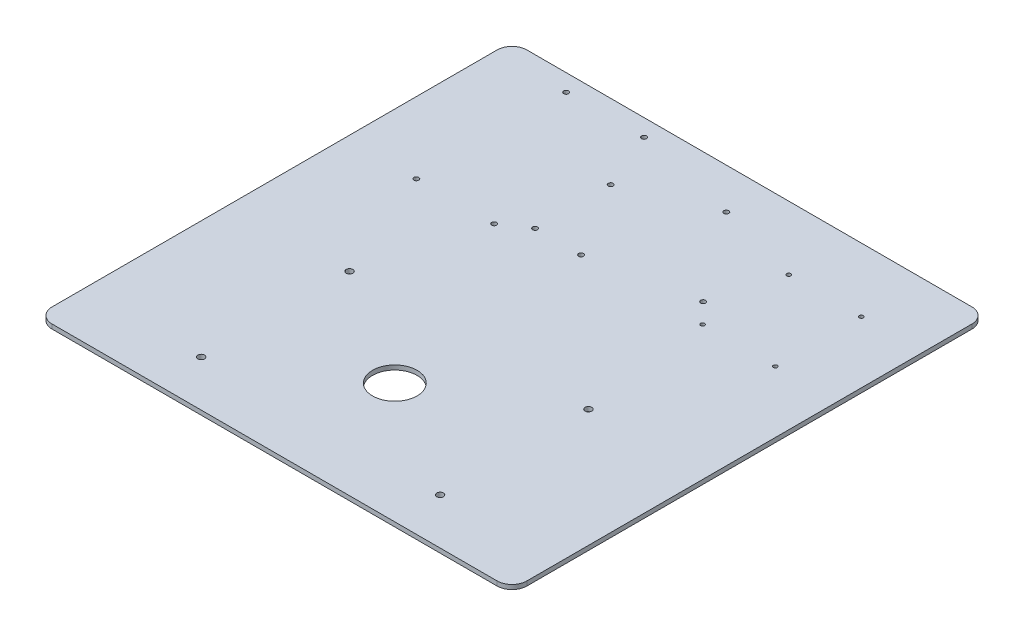
ISO-10303-21;
HEADER;
FILE_DESCRIPTION(('STEP AP214'),'2;1');
FILE_NAME('part.step','',(''),(''),'','','');
FILE_SCHEMA(('AUTOMOTIVE_DESIGN { 1 0 10303 214 1 1 1 1 }'));
ENDSEC;
DATA;
#1=APPLICATION_CONTEXT('core data for automotive mechanical design processes');
#2=APPLICATION_PROTOCOL_DEFINITION('international standard','automotive_design',2000,#1);
#3=PRODUCT_CONTEXT('',#1,'mechanical');
#4=PRODUCT('Part','Part','',(#3));
#5=PRODUCT_RELATED_PRODUCT_CATEGORY('part','',(#4));
#6=PRODUCT_DEFINITION_FORMATION('','',#4);
#7=PRODUCT_DEFINITION_CONTEXT('part definition',#1,'design');
#8=PRODUCT_DEFINITION('design','',#6,#7);
#9=PRODUCT_DEFINITION_SHAPE('','',#8);
#10=(LENGTH_UNIT() NAMED_UNIT(*) SI_UNIT(.MILLI.,.METRE.));
#11=(NAMED_UNIT(*) PLANE_ANGLE_UNIT() SI_UNIT($,.RADIAN.));
#12=(NAMED_UNIT(*) SI_UNIT($,.STERADIAN.) SOLID_ANGLE_UNIT());
#13=UNCERTAINTY_MEASURE_WITH_UNIT(LENGTH_MEASURE(1.E-05),#10,'distance_accuracy_value','');
#14=(GEOMETRIC_REPRESENTATION_CONTEXT(3) GLOBAL_UNCERTAINTY_ASSIGNED_CONTEXT((#13)) GLOBAL_UNIT_ASSIGNED_CONTEXT((#10,
#11,#12)) REPRESENTATION_CONTEXT('',''));
#15=CARTESIAN_POINT('',(0.,0.,0.));
#16=DIRECTION('',(0.,0.,1.));
#17=DIRECTION('',(1.,0.,0.));
#18=AXIS2_PLACEMENT_3D('',#15,#16,#17);
#19=CARTESIAN_POINT('',(205.2,3.,0.));
#20=DIRECTION('',(1.,0.,0.));
#21=DIRECTION('',(0.,0.,-1.));
#22=AXIS2_PLACEMENT_3D('',#19,#20,#21);
#23=PLANE('',#22);
#24=DIRECTION('',(0.,0.,1.));
#25=VECTOR('',#24,1.);
#26=CARTESIAN_POINT('',(205.2,0.,0.));
#27=LINE('',#26,#25);
#28=CARTESIAN_POINT('',(205.2,0.,-93.57));
#29=VERTEX_POINT('',#28);
#30=CARTESIAN_POINT('',(205.2,0.,206.43));
#31=VERTEX_POINT('',#30);
#32=EDGE_CURVE('E121',#29,#31,#27,.T.);
#33=ORIENTED_EDGE('',*,*,#32,.F.);
#34=DIRECTION('',(0.,-1.,0.));
#35=VECTOR('',#34,1.);
#36=CARTESIAN_POINT('',(205.2,3.,-93.57));
#37=LINE('',#36,#35);
#38=CARTESIAN_POINT('',(205.2,3.,-93.57));
#39=VERTEX_POINT('',#38);
#40=EDGE_CURVE('E143',#29,#39,#37,.F.);
#41=ORIENTED_EDGE('',*,*,#40,.T.);
#42=DIRECTION('',(0.,0.,1.));
#43=VECTOR('',#42,1.);
#44=CARTESIAN_POINT('',(205.2,3.,0.));
#45=LINE('',#44,#43);
#46=CARTESIAN_POINT('',(205.2,3.,206.43));
#47=VERTEX_POINT('',#46);
#48=EDGE_CURVE('E222',#39,#47,#45,.T.);
#49=ORIENTED_EDGE('',*,*,#48,.T.);
#50=DIRECTION('',(0.,-1.,0.));
#51=VECTOR('',#50,1.);
#52=CARTESIAN_POINT('',(205.2,0.,206.43));
#53=LINE('',#52,#51);
#54=EDGE_CURVE('E140',#47,#31,#53,.T.);
#55=ORIENTED_EDGE('',*,*,#54,.T.);
#56=EDGE_LOOP('',(#33,#41,#49,#55));
#57=FACE_BOUND('',#56,.T.);
#58=ADVANCED_FACE('F34',(#57),#23,.T.);
#59=CARTESIAN_POINT('',(0.,3.,-103.57));
#60=DIRECTION('',(0.,0.,-1.));
#61=DIRECTION('',(-1.,0.,0.));
#62=AXIS2_PLACEMENT_3D('',#59,#60,#61);
#63=PLANE('',#62);
#64=DIRECTION('',(1.,0.,0.));
#65=VECTOR('',#64,1.);
#66=CARTESIAN_POINT('',(0.,3.,-103.57));
#67=LINE('',#66,#65);
#68=CARTESIAN_POINT('',(-104.8,3.,-103.57));
#69=VERTEX_POINT('',#68);
#70=CARTESIAN_POINT('',(195.2,3.,-103.57));
#71=VERTEX_POINT('',#70);
#72=EDGE_CURVE('E225',#69,#71,#67,.T.);
#73=ORIENTED_EDGE('',*,*,#72,.T.);
#74=DIRECTION('',(0.,-1.,0.));
#75=VECTOR('',#74,1.);
#76=CARTESIAN_POINT('',(195.2,3.,-103.57));
#77=LINE('',#76,#75);
#78=CARTESIAN_POINT('',(195.2,0.,-103.57));
#79=VERTEX_POINT('',#78);
#80=EDGE_CURVE('E120',#71,#79,#77,.T.);
#81=ORIENTED_EDGE('',*,*,#80,.T.);
#82=DIRECTION('',(1.,0.,0.));
#83=VECTOR('',#82,1.);
#84=CARTESIAN_POINT('',(0.,0.,-103.57));
#85=LINE('',#84,#83);
#86=CARTESIAN_POINT('',(-104.8,0.,-103.57));
#87=VERTEX_POINT('',#86);
#88=EDGE_CURVE('E103',#87,#79,#85,.T.);
#89=ORIENTED_EDGE('',*,*,#88,.F.);
#90=DIRECTION('',(0.,-1.,0.));
#91=VECTOR('',#90,1.);
#92=CARTESIAN_POINT('',(-104.8,3.,-103.57));
#93=LINE('',#92,#91);
#94=EDGE_CURVE('E117',#87,#69,#93,.F.);
#95=ORIENTED_EDGE('',*,*,#94,.T.);
#96=EDGE_LOOP('',(#73,#81,#89,#95));
#97=FACE_BOUND('',#96,.T.);
#98=ADVANCED_FACE('F116',(#97),#63,.T.);
#99=CARTESIAN_POINT('',(-114.8,3.,0.));
#100=DIRECTION('',(1.,0.,0.));
#101=DIRECTION('',(0.,0.,-1.));
#102=AXIS2_PLACEMENT_3D('',#99,#100,#101);
#103=PLANE('',#102);
#104=DIRECTION('',(0.,0.,1.));
#105=VECTOR('',#104,1.);
#106=CARTESIAN_POINT('',(-114.8,3.,0.));
#107=LINE('',#106,#105);
#108=CARTESIAN_POINT('',(-114.8,3.,-93.57));
#109=VERTEX_POINT('',#108);
#110=CARTESIAN_POINT('',(-114.8,3.,206.43));
#111=VERTEX_POINT('',#110);
#112=EDGE_CURVE('E227',#109,#111,#107,.T.);
#113=ORIENTED_EDGE('',*,*,#112,.F.);
#114=DIRECTION('',(0.,-1.,0.));
#115=VECTOR('',#114,1.);
#116=CARTESIAN_POINT('',(-114.8,0.,-93.57));
#117=LINE('',#116,#115);
#118=CARTESIAN_POINT('',(-114.8,0.,-93.57));
#119=VERTEX_POINT('',#118);
#120=EDGE_CURVE('E153',#109,#119,#117,.T.);
#121=ORIENTED_EDGE('',*,*,#120,.T.);
#122=DIRECTION('',(0.,0.,1.));
#123=VECTOR('',#122,1.);
#124=CARTESIAN_POINT('',(-114.8,0.,0.));
#125=LINE('',#124,#123);
#126=CARTESIAN_POINT('',(-114.8,0.,206.43));
#127=VERTEX_POINT('',#126);
#128=EDGE_CURVE('E105',#119,#127,#125,.T.);
#129=ORIENTED_EDGE('',*,*,#128,.T.);
#130=DIRECTION('',(0.,-1.,0.));
#131=VECTOR('',#130,1.);
#132=CARTESIAN_POINT('',(-114.8,3.,206.43));
#133=LINE('',#132,#131);
#134=EDGE_CURVE('E151',#127,#111,#133,.F.);
#135=ORIENTED_EDGE('',*,*,#134,.T.);
#136=EDGE_LOOP('',(#113,#121,#129,#135));
#137=FACE_BOUND('',#136,.T.);
#138=ADVANCED_FACE('F304',(#137),#103,.F.);
#139=CARTESIAN_POINT('',(125.7,3.,85.43));
#140=DIRECTION('',(0.,-1.,0.));
#141=DIRECTION('',(0.,0.,-1.));
#142=AXIS2_PLACEMENT_3D('',#139,#140,#141);
#143=CYLINDRICAL_SURFACE('',#142,2.25000000000001);
#144=CARTESIAN_POINT('',(125.7,3.,85.43));
#145=DIRECTION('',(0.,1.,0.));
#146=DIRECTION('',(0.,0.,1.));
#147=AXIS2_PLACEMENT_3D('',#144,#145,#146);
#148=CIRCLE('',#147,2.25000000000001);
#149=CARTESIAN_POINT('',(125.7,3.,87.68));
#150=VERTEX_POINT('',#149);
#151=EDGE_CURVE('E131',#150,#150,#148,.T.);
#152=ORIENTED_EDGE('',*,*,#151,.T.);
#153=EDGE_LOOP('',(#152));
#154=FACE_BOUND('',#153,.T.);
#155=CARTESIAN_POINT('',(125.7,0.,85.43));
#156=DIRECTION('',(0.,1.,0.));
#157=DIRECTION('',(0.,0.,1.));
#158=AXIS2_PLACEMENT_3D('',#155,#156,#157);
#159=CIRCLE('',#158,2.25000000000001);
#160=CARTESIAN_POINT('',(125.7,0.,87.68));
#161=VERTEX_POINT('',#160);
#162=EDGE_CURVE('E179',#161,#161,#159,.T.);
#163=ORIENTED_EDGE('',*,*,#162,.F.);
#164=EDGE_LOOP('',(#163));
#165=FACE_BOUND('',#164,.T.);
#166=ADVANCED_FACE('F368',(#154,#165),#143,.F.);
#167=CARTESIAN_POINT('',(125.7,3.,185.43));
#168=DIRECTION('',(0.,-1.,0.));
#169=DIRECTION('',(0.,0.,-1.));
#170=AXIS2_PLACEMENT_3D('',#167,#168,#169);
#171=CYLINDRICAL_SURFACE('',#170,2.25000000000001);
#172=CARTESIAN_POINT('',(125.7,3.,185.43));
#173=DIRECTION('',(0.,1.,0.));
#174=DIRECTION('',(0.,0.,1.));
#175=AXIS2_PLACEMENT_3D('',#172,#173,#174);
#176=CIRCLE('',#175,2.25000000000001);
#177=CARTESIAN_POINT('',(125.7,3.,187.68));
#178=VERTEX_POINT('',#177);
#179=EDGE_CURVE('E242',#178,#178,#176,.T.);
#180=ORIENTED_EDGE('',*,*,#179,.T.);
#181=EDGE_LOOP('',(#180));
#182=FACE_BOUND('',#181,.T.);
#183=CARTESIAN_POINT('',(125.7,0.,185.43));
#184=DIRECTION('',(0.,1.,0.));
#185=DIRECTION('',(0.,0.,1.));
#186=AXIS2_PLACEMENT_3D('',#183,#184,#185);
#187=CIRCLE('',#186,2.25000000000001);
#188=CARTESIAN_POINT('',(125.7,0.,187.68));
#189=VERTEX_POINT('',#188);
#190=EDGE_CURVE('E177',#189,#189,#187,.T.);
#191=ORIENTED_EDGE('',*,*,#190,.F.);
#192=EDGE_LOOP('',(#191));
#193=FACE_BOUND('',#192,.T.);
#194=ADVANCED_FACE('F371',(#182,#193),#171,.F.);
#195=CARTESIAN_POINT('',(-35.2999999999999,3.,185.43));
#196=DIRECTION('',(0.,-1.,0.));
#197=DIRECTION('',(0.,0.,-1.));
#198=AXIS2_PLACEMENT_3D('',#195,#196,#197);
#199=CYLINDRICAL_SURFACE('',#198,2.25);
#200=CARTESIAN_POINT('',(-35.2999999999999,3.,185.43));
#201=DIRECTION('',(0.,1.,0.));
#202=DIRECTION('',(0.,0.,1.));
#203=AXIS2_PLACEMENT_3D('',#200,#201,#202);
#204=CIRCLE('',#203,2.25);
#205=CARTESIAN_POINT('',(-35.2999999999999,3.,187.68));
#206=VERTEX_POINT('',#205);
#207=EDGE_CURVE('E239',#206,#206,#204,.T.);
#208=ORIENTED_EDGE('',*,*,#207,.T.);
#209=EDGE_LOOP('',(#208));
#210=FACE_BOUND('',#209,.T.);
#211=CARTESIAN_POINT('',(-35.2999999999999,0.,185.43));
#212=DIRECTION('',(0.,1.,0.));
#213=DIRECTION('',(0.,0.,1.));
#214=AXIS2_PLACEMENT_3D('',#211,#212,#213);
#215=CIRCLE('',#214,2.25);
#216=CARTESIAN_POINT('',(-35.2999999999999,0.,187.68));
#217=VERTEX_POINT('',#216);
#218=EDGE_CURVE('E174',#217,#217,#215,.T.);
#219=ORIENTED_EDGE('',*,*,#218,.F.);
#220=EDGE_LOOP('',(#219));
#221=FACE_BOUND('',#220,.T.);
#222=ADVANCED_FACE('F375',(#210,#221),#199,.F.);
#223=CARTESIAN_POINT('',(45.2,3.,135.43));
#224=DIRECTION('',(0.,-1.,0.));
#225=DIRECTION('',(0.,0.,-1.));
#226=AXIS2_PLACEMENT_3D('',#223,#224,#225);
#227=CYLINDRICAL_SURFACE('',#226,15.);
#228=CARTESIAN_POINT('',(45.2,3.,135.43));
#229=DIRECTION('',(0.,1.,0.));
#230=DIRECTION('',(0.,0.,1.));
#231=AXIS2_PLACEMENT_3D('',#228,#229,#230);
#232=CIRCLE('',#231,15.);
#233=CARTESIAN_POINT('',(45.2,3.,150.43));
#234=VERTEX_POINT('',#233);
#235=EDGE_CURVE('E236',#234,#234,#232,.T.);
#236=ORIENTED_EDGE('',*,*,#235,.T.);
#237=EDGE_LOOP('',(#236));
#238=FACE_BOUND('',#237,.T.);
#239=CARTESIAN_POINT('',(45.2,0.,135.43));
#240=DIRECTION('',(0.,1.,0.));
#241=DIRECTION('',(0.,0.,1.));
#242=AXIS2_PLACEMENT_3D('',#239,#240,#241);
#243=CIRCLE('',#242,15.);
#244=CARTESIAN_POINT('',(45.2,0.,150.43));
#245=VERTEX_POINT('',#244);
#246=EDGE_CURVE('E171',#245,#245,#243,.T.);
#247=ORIENTED_EDGE('',*,*,#246,.F.);
#248=EDGE_LOOP('',(#247));
#249=FACE_BOUND('',#248,.T.);
#250=ADVANCED_FACE('F379',(#238,#249),#227,.F.);
#251=CARTESIAN_POINT('',(-14.3,3.,8.93000000000002));
#252=DIRECTION('',(0.,-1.,0.));
#253=DIRECTION('',(0.,0.,-1.));
#254=AXIS2_PLACEMENT_3D('',#251,#252,#253);
#255=CYLINDRICAL_SURFACE('',#254,1.65);
#256=CARTESIAN_POINT('',(-14.3,3.,8.93000000000002));
#257=DIRECTION('',(0.,1.,0.));
#258=DIRECTION('',(0.,0.,1.));
#259=AXIS2_PLACEMENT_3D('',#256,#257,#258);
#260=CIRCLE('',#259,1.65);
#261=CARTESIAN_POINT('',(-14.3,3.,10.58));
#262=VERTEX_POINT('',#261);
#263=EDGE_CURVE('E233',#262,#262,#260,.T.);
#264=ORIENTED_EDGE('',*,*,#263,.T.);
#265=EDGE_LOOP('',(#264));
#266=FACE_BOUND('',#265,.T.);
#267=CARTESIAN_POINT('',(-14.3,0.,8.93000000000002));
#268=DIRECTION('',(0.,1.,0.));
#269=DIRECTION('',(0.,0.,1.));
#270=AXIS2_PLACEMENT_3D('',#267,#268,#269);
#271=CIRCLE('',#270,1.65);
#272=CARTESIAN_POINT('',(-14.3,0.,10.58));
#273=VERTEX_POINT('',#272);
#274=EDGE_CURVE('E165',#273,#273,#271,.T.);
#275=ORIENTED_EDGE('',*,*,#274,.F.);
#276=EDGE_LOOP('',(#275));
#277=FACE_BOUND('',#276,.T.);
#278=ADVANCED_FACE('F383',(#266,#277),#255,.F.);
#279=CARTESIAN_POINT('',(-66.8,3.,8.93000000000002));
#280=DIRECTION('',(0.,-1.,0.));
#281=DIRECTION('',(0.,0.,-1.));
#282=AXIS2_PLACEMENT_3D('',#279,#280,#281);
#283=CYLINDRICAL_SURFACE('',#282,1.65);
#284=CARTESIAN_POINT('',(-66.8,3.,8.93000000000002));
#285=DIRECTION('',(0.,1.,0.));
#286=DIRECTION('',(0.,0.,1.));
#287=AXIS2_PLACEMENT_3D('',#284,#285,#286);
#288=CIRCLE('',#287,1.65);
#289=CARTESIAN_POINT('',(-66.8,3.,10.58));
#290=VERTEX_POINT('',#289);
#291=EDGE_CURVE('E230',#290,#290,#288,.T.);
#292=ORIENTED_EDGE('',*,*,#291,.T.);
#293=EDGE_LOOP('',(#292));
#294=FACE_BOUND('',#293,.T.);
#295=CARTESIAN_POINT('',(-66.8,0.,8.93000000000002));
#296=DIRECTION('',(0.,1.,0.));
#297=DIRECTION('',(0.,0.,1.));
#298=AXIS2_PLACEMENT_3D('',#295,#296,#297);
#299=CIRCLE('',#298,1.65);
#300=CARTESIAN_POINT('',(-66.8,0.,10.58));
#301=VERTEX_POINT('',#300);
#302=EDGE_CURVE('E162',#301,#301,#299,.T.);
#303=ORIENTED_EDGE('',*,*,#302,.F.);
#304=EDGE_LOOP('',(#303));
#305=FACE_BOUND('',#304,.T.);
#306=ADVANCED_FACE('F387',(#294,#305),#283,.F.);
#307=CARTESIAN_POINT('',(0.,3.,216.43));
#308=DIRECTION('',(0.,0.,-1.));
#309=DIRECTION('',(-1.,0.,0.));
#310=AXIS2_PLACEMENT_3D('',#307,#308,#309);
#311=PLANE('',#310);
#312=DIRECTION('',(1.,0.,0.));
#313=VECTOR('',#312,1.);
#314=CARTESIAN_POINT('',(0.,0.,216.43));
#315=LINE('',#314,#313);
#316=CARTESIAN_POINT('',(-104.8,0.,216.43));
#317=VERTEX_POINT('',#316);
#318=CARTESIAN_POINT('',(195.2,0.,216.43));
#319=VERTEX_POINT('',#318);
#320=EDGE_CURVE('E158',#317,#319,#315,.T.);
#321=ORIENTED_EDGE('',*,*,#320,.T.);
#322=DIRECTION('',(0.,-1.,0.));
#323=VECTOR('',#322,1.);
#324=CARTESIAN_POINT('',(195.2,3.,216.43));
#325=LINE('',#324,#323);
#326=CARTESIAN_POINT('',(195.2,3.,216.43));
#327=VERTEX_POINT('',#326);
#328=EDGE_CURVE('E11',#319,#327,#325,.F.);
#329=ORIENTED_EDGE('',*,*,#328,.T.);
#330=DIRECTION('',(1.,0.,0.));
#331=VECTOR('',#330,1.);
#332=CARTESIAN_POINT('',(0.,3.,216.43));
#333=LINE('',#332,#331);
#334=CARTESIAN_POINT('',(-104.8,3.,216.43));
#335=VERTEX_POINT('',#334);
#336=EDGE_CURVE('E159',#335,#327,#333,.T.);
#337=ORIENTED_EDGE('',*,*,#336,.F.);
#338=DIRECTION('',(0.,-1.,0.));
#339=VECTOR('',#338,1.);
#340=CARTESIAN_POINT('',(-104.8,3.,216.43));
#341=LINE('',#340,#339);
#342=EDGE_CURVE('E42',#335,#317,#341,.T.);
#343=ORIENTED_EDGE('',*,*,#342,.T.);
#344=EDGE_LOOP('',(#321,#329,#337,#343));
#345=FACE_BOUND('',#344,.T.);
#346=ADVANCED_FACE('F157',(#345),#311,.F.);
#347=CARTESIAN_POINT('',(-14.3000000000004,3.,-92.07));
#348=DIRECTION('',(0.,-1.,0.));
#349=DIRECTION('',(0.,0.,-1.));
#350=AXIS2_PLACEMENT_3D('',#347,#348,#349);
#351=CYLINDRICAL_SURFACE('',#350,1.65);
#352=CARTESIAN_POINT('',(-14.3000000000004,3.,-92.07));
#353=DIRECTION('',(0.,1.,0.));
#354=DIRECTION('',(0.,0.,1.));
#355=AXIS2_PLACEMENT_3D('',#352,#353,#354);
#356=CIRCLE('',#355,1.65);
#357=CARTESIAN_POINT('',(-14.3000000000004,3.,-90.42));
#358=VERTEX_POINT('',#357);
#359=EDGE_CURVE('E219',#358,#358,#356,.T.);
#360=ORIENTED_EDGE('',*,*,#359,.T.);
#361=EDGE_LOOP('',(#360));
#362=FACE_BOUND('',#361,.T.);
#363=CARTESIAN_POINT('',(-14.3000000000004,0.,-92.07));
#364=DIRECTION('',(0.,1.,0.));
#365=DIRECTION('',(0.,0.,1.));
#366=AXIS2_PLACEMENT_3D('',#363,#364,#365);
#367=CIRCLE('',#366,1.65);
#368=CARTESIAN_POINT('',(-14.3000000000004,0.,-90.42));
#369=VERTEX_POINT('',#368);
#370=EDGE_CURVE('E277',#369,#369,#367,.T.);
#371=ORIENTED_EDGE('',*,*,#370,.F.);
#372=EDGE_LOOP('',(#371));
#373=FACE_BOUND('',#372,.T.);
#374=ADVANCED_FACE('F308',(#362,#373),#351,.F.);
#375=CARTESIAN_POINT('',(-66.8000000000004,3.,-92.07));
#376=DIRECTION('',(0.,-1.,0.));
#377=DIRECTION('',(0.,0.,-1.));
#378=AXIS2_PLACEMENT_3D('',#375,#376,#377);
#379=CYLINDRICAL_SURFACE('',#378,1.65);
#380=CARTESIAN_POINT('',(-66.8000000000004,3.,-92.07));
#381=DIRECTION('',(0.,1.,0.));
#382=DIRECTION('',(0.,0.,1.));
#383=AXIS2_PLACEMENT_3D('',#380,#381,#382);
#384=CIRCLE('',#383,1.65);
#385=CARTESIAN_POINT('',(-66.8000000000004,3.,-90.42));
#386=VERTEX_POINT('',#385);
#387=EDGE_CURVE('E216',#386,#386,#384,.T.);
#388=ORIENTED_EDGE('',*,*,#387,.T.);
#389=EDGE_LOOP('',(#388));
#390=FACE_BOUND('',#389,.T.);
#391=CARTESIAN_POINT('',(-66.8000000000004,0.,-92.07));
#392=DIRECTION('',(0.,1.,0.));
#393=DIRECTION('',(0.,0.,1.));
#394=AXIS2_PLACEMENT_3D('',#391,#392,#393);
#395=CIRCLE('',#394,1.65);
#396=CARTESIAN_POINT('',(-66.8000000000004,0.,-90.42));
#397=VERTEX_POINT('',#396);
#398=EDGE_CURVE('E274',#397,#397,#395,.T.);
#399=ORIENTED_EDGE('',*,*,#398,.F.);
#400=EDGE_LOOP('',(#399));
#401=FACE_BOUND('',#400,.T.);
#402=ADVANCED_FACE('F311',(#390,#401),#379,.F.);
#403=CARTESIAN_POINT('',(101.6,3.,-16.));
#404=DIRECTION('',(0.,-1.,0.));
#405=DIRECTION('',(0.,0.,-1.));
#406=AXIS2_PLACEMENT_3D('',#403,#404,#405);
#407=CYLINDRICAL_SURFACE('',#406,1.65);
#408=CARTESIAN_POINT('',(101.6,3.,-16.));
#409=DIRECTION('',(0.,1.,0.));
#410=DIRECTION('',(0.,0.,1.));
#411=AXIS2_PLACEMENT_3D('',#408,#409,#410);
#412=CIRCLE('',#411,1.65);
#413=CARTESIAN_POINT('',(101.6,3.,-14.35));
#414=VERTEX_POINT('',#413);
#415=EDGE_CURVE('E213',#414,#414,#412,.T.);
#416=ORIENTED_EDGE('',*,*,#415,.T.);
#417=EDGE_LOOP('',(#416));
#418=FACE_BOUND('',#417,.T.);
#419=CARTESIAN_POINT('',(101.6,0.,-16.));
#420=DIRECTION('',(0.,1.,0.));
#421=DIRECTION('',(0.,0.,1.));
#422=AXIS2_PLACEMENT_3D('',#419,#420,#421);
#423=CIRCLE('',#422,1.65);
#424=CARTESIAN_POINT('',(101.6,0.,-14.35));
#425=VERTEX_POINT('',#424);
#426=EDGE_CURVE('E271',#425,#425,#423,.T.);
#427=ORIENTED_EDGE('',*,*,#426,.F.);
#428=EDGE_LOOP('',(#427));
#429=FACE_BOUND('',#428,.T.);
#430=ADVANCED_FACE('F315',(#418,#429),#407,.F.);
#431=CARTESIAN_POINT('',(2.15,3.,-2.15));
#432=DIRECTION('',(0.,-1.,0.));
#433=DIRECTION('',(0.,0.,-1.));
#434=AXIS2_PLACEMENT_3D('',#431,#432,#433);
#435=CYLINDRICAL_SURFACE('',#434,1.65);
#436=CARTESIAN_POINT('',(2.15,3.,-2.15));
#437=DIRECTION('',(0.,1.,0.));
#438=DIRECTION('',(0.,0.,1.));
#439=AXIS2_PLACEMENT_3D('',#436,#437,#438);
#440=CIRCLE('',#439,1.65);
#441=CARTESIAN_POINT('',(2.15,3.,-0.499999999999999));
#442=VERTEX_POINT('',#441);
#443=EDGE_CURVE('E210',#442,#442,#440,.T.);
#444=ORIENTED_EDGE('',*,*,#443,.T.);
#445=EDGE_LOOP('',(#444));
#446=FACE_BOUND('',#445,.T.);
#447=CARTESIAN_POINT('',(2.15,0.,-2.15));
#448=DIRECTION('',(0.,1.,0.));
#449=DIRECTION('',(0.,0.,1.));
#450=AXIS2_PLACEMENT_3D('',#447,#448,#449);
#451=CIRCLE('',#450,1.65);
#452=CARTESIAN_POINT('',(2.15,0.,-0.499999999999999));
#453=VERTEX_POINT('',#452);
#454=EDGE_CURVE('E268',#453,#453,#451,.T.);
#455=ORIENTED_EDGE('',*,*,#454,.F.);
#456=EDGE_LOOP('',(#455));
#457=FACE_BOUND('',#456,.T.);
#458=ADVANCED_FACE('F319',(#446,#457),#435,.F.);
#459=CARTESIAN_POINT('',(33.15,3.,-2.15));
#460=DIRECTION('',(0.,-1.,0.));
#461=DIRECTION('',(0.,0.,-1.));
#462=AXIS2_PLACEMENT_3D('',#459,#460,#461);
#463=CYLINDRICAL_SURFACE('',#462,1.65);
#464=CARTESIAN_POINT('',(33.15,3.,-2.15));
#465=DIRECTION('',(0.,1.,0.));
#466=DIRECTION('',(0.,0.,1.));
#467=AXIS2_PLACEMENT_3D('',#464,#465,#466);
#468=CIRCLE('',#467,1.65);
#469=CARTESIAN_POINT('',(33.15,3.,-0.499999999999998));
#470=VERTEX_POINT('',#469);
#471=EDGE_CURVE('E207',#470,#470,#468,.T.);
#472=ORIENTED_EDGE('',*,*,#471,.T.);
#473=EDGE_LOOP('',(#472));
#474=FACE_BOUND('',#473,.T.);
#475=CARTESIAN_POINT('',(33.15,0.,-2.15));
#476=DIRECTION('',(0.,1.,0.));
#477=DIRECTION('',(0.,0.,1.));
#478=AXIS2_PLACEMENT_3D('',#475,#476,#477);
#479=CIRCLE('',#478,1.65);
#480=CARTESIAN_POINT('',(33.15,0.,-0.499999999999998));
#481=VERTEX_POINT('',#480);
#482=EDGE_CURVE('E265',#481,#481,#479,.T.);
#483=ORIENTED_EDGE('',*,*,#482,.F.);
#484=EDGE_LOOP('',(#483));
#485=FACE_BOUND('',#484,.T.);
#486=ADVANCED_FACE('F323',(#474,#485),#463,.F.);
#487=CARTESIAN_POINT('',(2.15,3.,-53.15));
#488=DIRECTION('',(0.,-1.,0.));
#489=DIRECTION('',(0.,0.,-1.));
#490=AXIS2_PLACEMENT_3D('',#487,#488,#489);
#491=CYLINDRICAL_SURFACE('',#490,1.65);
#492=CARTESIAN_POINT('',(2.15,3.,-53.15));
#493=DIRECTION('',(0.,1.,0.));
#494=DIRECTION('',(0.,0.,1.));
#495=AXIS2_PLACEMENT_3D('',#492,#493,#494);
#496=CIRCLE('',#495,1.65);
#497=CARTESIAN_POINT('',(2.15,3.,-51.5));
#498=VERTEX_POINT('',#497);
#499=EDGE_CURVE('E204',#498,#498,#496,.T.);
#500=ORIENTED_EDGE('',*,*,#499,.T.);
#501=EDGE_LOOP('',(#500));
#502=FACE_BOUND('',#501,.T.);
#503=CARTESIAN_POINT('',(2.15,0.,-53.15));
#504=DIRECTION('',(0.,1.,0.));
#505=DIRECTION('',(0.,0.,1.));
#506=AXIS2_PLACEMENT_3D('',#503,#504,#505);
#507=CIRCLE('',#506,1.65);
#508=CARTESIAN_POINT('',(2.15,0.,-51.5));
#509=VERTEX_POINT('',#508);
#510=EDGE_CURVE('E262',#509,#509,#507,.T.);
#511=ORIENTED_EDGE('',*,*,#510,.F.);
#512=EDGE_LOOP('',(#511));
#513=FACE_BOUND('',#512,.T.);
#514=ADVANCED_FACE('F327',(#502,#513),#491,.F.);
#515=CARTESIAN_POINT('',(57.1,3.,-76.14));
#516=DIRECTION('',(0.,-1.,0.));
#517=DIRECTION('',(0.,0.,-1.));
#518=AXIS2_PLACEMENT_3D('',#515,#516,#517);
#519=CYLINDRICAL_SURFACE('',#518,1.65);
#520=CARTESIAN_POINT('',(57.1,3.,-76.14));
#521=DIRECTION('',(0.,1.,0.));
#522=DIRECTION('',(0.,0.,1.));
#523=AXIS2_PLACEMENT_3D('',#520,#521,#522);
#524=CIRCLE('',#523,1.65);
#525=CARTESIAN_POINT('',(57.1,3.,-74.49));
#526=VERTEX_POINT('',#525);
#527=EDGE_CURVE('E201',#526,#526,#524,.T.);
#528=ORIENTED_EDGE('',*,*,#527,.T.);
#529=EDGE_LOOP('',(#528));
#530=FACE_BOUND('',#529,.T.);
#531=CARTESIAN_POINT('',(57.1,0.,-76.14));
#532=DIRECTION('',(0.,1.,0.));
#533=DIRECTION('',(0.,0.,1.));
#534=AXIS2_PLACEMENT_3D('',#531,#532,#533);
#535=CIRCLE('',#534,1.65);
#536=CARTESIAN_POINT('',(57.1,0.,-74.49));
#537=VERTEX_POINT('',#536);
#538=EDGE_CURVE('E259',#537,#537,#535,.T.);
#539=ORIENTED_EDGE('',*,*,#538,.F.);
#540=EDGE_LOOP('',(#539));
#541=FACE_BOUND('',#540,.T.);
#542=ADVANCED_FACE('F331',(#530,#541),#519,.F.);
#543=CARTESIAN_POINT('',(163.7,3.,-2.57));
#544=DIRECTION('',(0.,-1.,0.));
#545=DIRECTION('',(0.,0.,-1.));
#546=AXIS2_PLACEMENT_3D('',#543,#544,#545);
#547=CYLINDRICAL_SURFACE('',#546,1.34999999999998);
#548=CARTESIAN_POINT('',(163.7,3.,-2.57));
#549=DIRECTION('',(0.,1.,0.));
#550=DIRECTION('',(0.,0.,1.));
#551=AXIS2_PLACEMENT_3D('',#548,#549,#550);
#552=CIRCLE('',#551,1.34999999999998);
#553=CARTESIAN_POINT('',(163.7,3.,-1.22000000000002));
#554=VERTEX_POINT('',#553);
#555=EDGE_CURVE('E198',#554,#554,#552,.T.);
#556=ORIENTED_EDGE('',*,*,#555,.T.);
#557=EDGE_LOOP('',(#556));
#558=FACE_BOUND('',#557,.T.);
#559=CARTESIAN_POINT('',(163.7,0.,-2.57));
#560=DIRECTION('',(0.,1.,0.));
#561=DIRECTION('',(0.,0.,1.));
#562=AXIS2_PLACEMENT_3D('',#559,#560,#561);
#563=CIRCLE('',#562,1.34999999999998);
#564=CARTESIAN_POINT('',(163.7,0.,-1.22000000000002));
#565=VERTEX_POINT('',#564);
#566=EDGE_CURVE('E256',#565,#565,#563,.T.);
#567=ORIENTED_EDGE('',*,*,#566,.F.);
#568=EDGE_LOOP('',(#567));
#569=FACE_BOUND('',#568,.T.);
#570=ADVANCED_FACE('F335',(#558,#569),#547,.F.);
#571=CARTESIAN_POINT('',(114.7,3.,-2.57));
#572=DIRECTION('',(0.,-1.,0.));
#573=DIRECTION('',(0.,0.,-1.));
#574=AXIS2_PLACEMENT_3D('',#571,#572,#573);
#575=CYLINDRICAL_SURFACE('',#574,1.35000000000001);
#576=CARTESIAN_POINT('',(114.7,3.,-2.57));
#577=DIRECTION('',(0.,1.,0.));
#578=DIRECTION('',(0.,0.,1.));
#579=AXIS2_PLACEMENT_3D('',#576,#577,#578);
#580=CIRCLE('',#579,1.35000000000001);
#581=CARTESIAN_POINT('',(114.7,3.,-1.21999999999999));
#582=VERTEX_POINT('',#581);
#583=EDGE_CURVE('E193',#582,#582,#580,.T.);
#584=ORIENTED_EDGE('',*,*,#583,.T.);
#585=EDGE_LOOP('',(#584));
#586=FACE_BOUND('',#585,.T.);
#587=CARTESIAN_POINT('',(114.7,0.,-2.57));
#588=DIRECTION('',(0.,1.,0.));
#589=DIRECTION('',(0.,0.,1.));
#590=AXIS2_PLACEMENT_3D('',#587,#588,#589);
#591=CIRCLE('',#590,1.35000000000001);
#592=CARTESIAN_POINT('',(114.7,0.,-1.21999999999999));
#593=VERTEX_POINT('',#592);
#594=EDGE_CURVE('E253',#593,#593,#591,.T.);
#595=ORIENTED_EDGE('',*,*,#594,.F.);
#596=EDGE_LOOP('',(#595));
#597=FACE_BOUND('',#596,.T.);
#598=ADVANCED_FACE('F339',(#586,#597),#575,.F.);
#599=CARTESIAN_POINT('',(163.7,3.,-60.57));
#600=DIRECTION('',(0.,-1.,0.));
#601=DIRECTION('',(0.,0.,-1.));
#602=AXIS2_PLACEMENT_3D('',#599,#600,#601);
#603=CYLINDRICAL_SURFACE('',#602,1.34999999999998);
#604=CARTESIAN_POINT('',(163.7,3.,-60.57));
#605=DIRECTION('',(0.,1.,0.));
#606=DIRECTION('',(0.,0.,1.));
#607=AXIS2_PLACEMENT_3D('',#604,#605,#606);
#608=CIRCLE('',#607,1.34999999999998);
#609=CARTESIAN_POINT('',(163.7,3.,-59.22));
#610=VERTEX_POINT('',#609);
#611=EDGE_CURVE('E188',#610,#610,#608,.T.);
#612=ORIENTED_EDGE('',*,*,#611,.T.);
#613=EDGE_LOOP('',(#612));
#614=FACE_BOUND('',#613,.T.);
#615=CARTESIAN_POINT('',(163.7,0.,-60.57));
#616=DIRECTION('',(0.,1.,0.));
#617=DIRECTION('',(0.,0.,1.));
#618=AXIS2_PLACEMENT_3D('',#615,#616,#617);
#619=CIRCLE('',#618,1.34999999999998);
#620=CARTESIAN_POINT('',(163.7,0.,-59.22));
#621=VERTEX_POINT('',#620);
#622=EDGE_CURVE('E250',#621,#621,#619,.T.);
#623=ORIENTED_EDGE('',*,*,#622,.F.);
#624=EDGE_LOOP('',(#623));
#625=FACE_BOUND('',#624,.T.);
#626=ADVANCED_FACE('F343',(#614,#625),#603,.F.);
#627=CARTESIAN_POINT('',(114.7,3.,-60.57));
#628=DIRECTION('',(0.,-1.,0.));
#629=DIRECTION('',(0.,0.,-1.));
#630=AXIS2_PLACEMENT_3D('',#627,#628,#629);
#631=CYLINDRICAL_SURFACE('',#630,1.35000000000001);
#632=CARTESIAN_POINT('',(114.7,3.,-60.57));
#633=DIRECTION('',(0.,1.,0.));
#634=DIRECTION('',(0.,0.,1.));
#635=AXIS2_PLACEMENT_3D('',#632,#633,#634);
#636=CIRCLE('',#635,1.35000000000001);
#637=CARTESIAN_POINT('',(114.7,3.,-59.22));
#638=VERTEX_POINT('',#637);
#639=EDGE_CURVE('E184',#638,#638,#636,.T.);
#640=ORIENTED_EDGE('',*,*,#639,.T.);
#641=EDGE_LOOP('',(#640));
#642=FACE_BOUND('',#641,.T.);
#643=CARTESIAN_POINT('',(114.7,0.,-60.57));
#644=DIRECTION('',(0.,1.,0.));
#645=DIRECTION('',(0.,0.,1.));
#646=AXIS2_PLACEMENT_3D('',#643,#644,#645);
#647=CIRCLE('',#646,1.35000000000001);
#648=CARTESIAN_POINT('',(114.7,0.,-59.22));
#649=VERTEX_POINT('',#648);
#650=EDGE_CURVE('E247',#649,#649,#647,.T.);
#651=ORIENTED_EDGE('',*,*,#650,.F.);
#652=EDGE_LOOP('',(#651));
#653=FACE_BOUND('',#652,.T.);
#654=ADVANCED_FACE('F347',(#642,#653),#631,.F.);
#655=CARTESIAN_POINT('',(-35.3,3.,85.43));
#656=DIRECTION('',(0.,-1.,0.));
#657=DIRECTION('',(0.,0.,-1.));
#658=AXIS2_PLACEMENT_3D('',#655,#656,#657);
#659=CYLINDRICAL_SURFACE('',#658,2.25);
#660=CARTESIAN_POINT('',(-35.3,3.,85.43));
#661=DIRECTION('',(0.,1.,0.));
#662=DIRECTION('',(0.,0.,1.));
#663=AXIS2_PLACEMENT_3D('',#660,#661,#662);
#664=CIRCLE('',#663,2.25);
#665=CARTESIAN_POINT('',(-35.3,3.,87.68));
#666=VERTEX_POINT('',#665);
#667=EDGE_CURVE('E126',#666,#666,#664,.T.);
#668=ORIENTED_EDGE('',*,*,#667,.T.);
#669=EDGE_LOOP('',(#668));
#670=FACE_BOUND('',#669,.T.);
#671=CARTESIAN_POINT('',(-35.3,0.,85.43));
#672=DIRECTION('',(0.,1.,0.));
#673=DIRECTION('',(0.,0.,1.));
#674=AXIS2_PLACEMENT_3D('',#671,#672,#673);
#675=CIRCLE('',#674,2.25);
#676=CARTESIAN_POINT('',(-35.3,0.,87.68));
#677=VERTEX_POINT('',#676);
#678=EDGE_CURVE('E134',#677,#677,#675,.T.);
#679=ORIENTED_EDGE('',*,*,#678,.F.);
#680=EDGE_LOOP('',(#679));
#681=FACE_BOUND('',#680,.T.);
#682=ADVANCED_FACE('F351',(#670,#681),#659,.F.);
#683=CARTESIAN_POINT('',(0.,3.,0.));
#684=DIRECTION('',(0.,1.,0.));
#685=DIRECTION('',(0.,0.,1.));
#686=AXIS2_PLACEMENT_3D('',#683,#684,#685);
#687=PLANE('',#686);
#688=ORIENTED_EDGE('',*,*,#639,.F.);
#689=EDGE_LOOP('',(#688));
#690=FACE_BOUND('',#689,.T.);
#691=ORIENTED_EDGE('',*,*,#611,.F.);
#692=EDGE_LOOP('',(#691));
#693=FACE_BOUND('',#692,.T.);
#694=ORIENTED_EDGE('',*,*,#583,.F.);
#695=EDGE_LOOP('',(#694));
#696=FACE_BOUND('',#695,.T.);
#697=ORIENTED_EDGE('',*,*,#555,.F.);
#698=EDGE_LOOP('',(#697));
#699=FACE_BOUND('',#698,.T.);
#700=ORIENTED_EDGE('',*,*,#527,.F.);
#701=EDGE_LOOP('',(#700));
#702=FACE_BOUND('',#701,.T.);
#703=ORIENTED_EDGE('',*,*,#499,.F.);
#704=EDGE_LOOP('',(#703));
#705=FACE_BOUND('',#704,.T.);
#706=ORIENTED_EDGE('',*,*,#471,.F.);
#707=EDGE_LOOP('',(#706));
#708=FACE_BOUND('',#707,.T.);
#709=ORIENTED_EDGE('',*,*,#443,.F.);
#710=EDGE_LOOP('',(#709));
#711=FACE_BOUND('',#710,.T.);
#712=ORIENTED_EDGE('',*,*,#415,.F.);
#713=EDGE_LOOP('',(#712));
#714=FACE_BOUND('',#713,.T.);
#715=ORIENTED_EDGE('',*,*,#387,.F.);
#716=EDGE_LOOP('',(#715));
#717=FACE_BOUND('',#716,.T.);
#718=ORIENTED_EDGE('',*,*,#359,.F.);
#719=EDGE_LOOP('',(#718));
#720=FACE_BOUND('',#719,.T.);
#721=ORIENTED_EDGE('',*,*,#48,.F.);
#722=CARTESIAN_POINT('',(195.2,3.,-93.57));
#723=DIRECTION('',(0.,1.,0.));
#724=DIRECTION('',(0.,0.,1.));
#725=AXIS2_PLACEMENT_3D('',#722,#723,#724);
#726=CIRCLE('',#725,10.);
#727=EDGE_CURVE('E149',#39,#71,#726,.T.);
#728=ORIENTED_EDGE('',*,*,#727,.T.);
#729=ORIENTED_EDGE('',*,*,#72,.F.);
#730=CARTESIAN_POINT('',(-104.8,3.,-93.57));
#731=DIRECTION('',(0.,1.,0.));
#732=DIRECTION('',(0.,0.,1.));
#733=AXIS2_PLACEMENT_3D('',#730,#731,#732);
#734=CIRCLE('',#733,10.);
#735=EDGE_CURVE('E125',#69,#109,#734,.T.);
#736=ORIENTED_EDGE('',*,*,#735,.T.);
#737=ORIENTED_EDGE('',*,*,#112,.T.);
#738=CARTESIAN_POINT('',(-104.8,3.,206.43));
#739=DIRECTION('',(0.,1.,0.));
#740=DIRECTION('',(0.,0.,1.));
#741=AXIS2_PLACEMENT_3D('',#738,#739,#740);
#742=CIRCLE('',#741,10.);
#743=EDGE_CURVE('E54',#111,#335,#742,.T.);
#744=ORIENTED_EDGE('',*,*,#743,.T.);
#745=ORIENTED_EDGE('',*,*,#336,.T.);
#746=CARTESIAN_POINT('',(195.2,3.,206.43));
#747=DIRECTION('',(0.,1.,0.));
#748=DIRECTION('',(0.,0.,1.));
#749=AXIS2_PLACEMENT_3D('',#746,#747,#748);
#750=CIRCLE('',#749,10.);
#751=EDGE_CURVE('E146',#327,#47,#750,.T.);
#752=ORIENTED_EDGE('',*,*,#751,.T.);
#753=EDGE_LOOP('',(#721,#728,#729,#736,#737,#744,#745,#752));
#754=FACE_BOUND('',#753,.T.);
#755=ORIENTED_EDGE('',*,*,#291,.F.);
#756=EDGE_LOOP('',(#755));
#757=FACE_BOUND('',#756,.T.);
#758=ORIENTED_EDGE('',*,*,#263,.F.);
#759=EDGE_LOOP('',(#758));
#760=FACE_BOUND('',#759,.T.);
#761=ORIENTED_EDGE('',*,*,#235,.F.);
#762=EDGE_LOOP('',(#761));
#763=FACE_BOUND('',#762,.T.);
#764=ORIENTED_EDGE('',*,*,#207,.F.);
#765=EDGE_LOOP('',(#764));
#766=FACE_BOUND('',#765,.T.);
#767=ORIENTED_EDGE('',*,*,#179,.F.);
#768=EDGE_LOOP('',(#767));
#769=FACE_BOUND('',#768,.T.);
#770=ORIENTED_EDGE('',*,*,#151,.F.);
#771=EDGE_LOOP('',(#770));
#772=FACE_BOUND('',#771,.T.);
#773=ORIENTED_EDGE('',*,*,#667,.F.);
#774=EDGE_LOOP('',(#773));
#775=FACE_BOUND('',#774,.T.);
#776=ADVANCED_FACE('F288',(#690,#693,#696,#699,#702,#705,#708,#711,#714,#717,#720,#754,#757,
#760,#763,#766,#769,#772,#775),#687,.T.);
#777=CARTESIAN_POINT('',(0.,0.,0.));
#778=DIRECTION('',(0.,1.,0.));
#779=DIRECTION('',(0.,0.,1.));
#780=AXIS2_PLACEMENT_3D('',#777,#778,#779);
#781=PLANE('',#780);
#782=ORIENTED_EDGE('',*,*,#650,.T.);
#783=EDGE_LOOP('',(#782));
#784=FACE_BOUND('',#783,.T.);
#785=ORIENTED_EDGE('',*,*,#622,.T.);
#786=EDGE_LOOP('',(#785));
#787=FACE_BOUND('',#786,.T.);
#788=ORIENTED_EDGE('',*,*,#594,.T.);
#789=EDGE_LOOP('',(#788));
#790=FACE_BOUND('',#789,.T.);
#791=ORIENTED_EDGE('',*,*,#566,.T.);
#792=EDGE_LOOP('',(#791));
#793=FACE_BOUND('',#792,.T.);
#794=ORIENTED_EDGE('',*,*,#538,.T.);
#795=EDGE_LOOP('',(#794));
#796=FACE_BOUND('',#795,.T.);
#797=ORIENTED_EDGE('',*,*,#510,.T.);
#798=EDGE_LOOP('',(#797));
#799=FACE_BOUND('',#798,.T.);
#800=ORIENTED_EDGE('',*,*,#482,.T.);
#801=EDGE_LOOP('',(#800));
#802=FACE_BOUND('',#801,.T.);
#803=ORIENTED_EDGE('',*,*,#454,.T.);
#804=EDGE_LOOP('',(#803));
#805=FACE_BOUND('',#804,.T.);
#806=ORIENTED_EDGE('',*,*,#426,.T.);
#807=EDGE_LOOP('',(#806));
#808=FACE_BOUND('',#807,.T.);
#809=ORIENTED_EDGE('',*,*,#398,.T.);
#810=EDGE_LOOP('',(#809));
#811=FACE_BOUND('',#810,.T.);
#812=ORIENTED_EDGE('',*,*,#370,.T.);
#813=EDGE_LOOP('',(#812));
#814=FACE_BOUND('',#813,.T.);
#815=ORIENTED_EDGE('',*,*,#88,.T.);
#816=CARTESIAN_POINT('',(195.2,0.,-93.57));
#817=DIRECTION('',(0.,1.,0.));
#818=DIRECTION('',(0.,0.,1.));
#819=AXIS2_PLACEMENT_3D('',#816,#817,#818);
#820=CIRCLE('',#819,10.);
#821=EDGE_CURVE('E110',#79,#29,#820,.F.);
#822=ORIENTED_EDGE('',*,*,#821,.T.);
#823=ORIENTED_EDGE('',*,*,#32,.T.);
#824=CARTESIAN_POINT('',(195.2,0.,206.43));
#825=DIRECTION('',(0.,1.,0.));
#826=DIRECTION('',(0.,0.,1.));
#827=AXIS2_PLACEMENT_3D('',#824,#825,#826);
#828=CIRCLE('',#827,10.);
#829=EDGE_CURVE('E111',#31,#319,#828,.F.);
#830=ORIENTED_EDGE('',*,*,#829,.T.);
#831=ORIENTED_EDGE('',*,*,#320,.F.);
#832=CARTESIAN_POINT('',(-104.8,0.,206.43));
#833=DIRECTION('',(0.,1.,0.));
#834=DIRECTION('',(0.,0.,1.));
#835=AXIS2_PLACEMENT_3D('',#832,#833,#834);
#836=CIRCLE('',#835,10.);
#837=EDGE_CURVE('E128',#317,#127,#836,.F.);
#838=ORIENTED_EDGE('',*,*,#837,.T.);
#839=ORIENTED_EDGE('',*,*,#128,.F.);
#840=CARTESIAN_POINT('',(-104.8,0.,-93.57));
#841=DIRECTION('',(0.,1.,0.));
#842=DIRECTION('',(0.,0.,1.));
#843=AXIS2_PLACEMENT_3D('',#840,#841,#842);
#844=CIRCLE('',#843,10.);
#845=EDGE_CURVE('E99',#119,#87,#844,.F.);
#846=ORIENTED_EDGE('',*,*,#845,.T.);
#847=EDGE_LOOP('',(#815,#822,#823,#830,#831,#838,#839,#846));
#848=FACE_BOUND('',#847,.T.);
#849=ORIENTED_EDGE('',*,*,#302,.T.);
#850=EDGE_LOOP('',(#849));
#851=FACE_BOUND('',#850,.T.);
#852=ORIENTED_EDGE('',*,*,#274,.T.);
#853=EDGE_LOOP('',(#852));
#854=FACE_BOUND('',#853,.T.);
#855=ORIENTED_EDGE('',*,*,#246,.T.);
#856=EDGE_LOOP('',(#855));
#857=FACE_BOUND('',#856,.T.);
#858=ORIENTED_EDGE('',*,*,#218,.T.);
#859=EDGE_LOOP('',(#858));
#860=FACE_BOUND('',#859,.T.);
#861=ORIENTED_EDGE('',*,*,#190,.T.);
#862=EDGE_LOOP('',(#861));
#863=FACE_BOUND('',#862,.T.);
#864=ORIENTED_EDGE('',*,*,#162,.T.);
#865=EDGE_LOOP('',(#864));
#866=FACE_BOUND('',#865,.T.);
#867=ORIENTED_EDGE('',*,*,#678,.T.);
#868=EDGE_LOOP('',(#867));
#869=FACE_BOUND('',#868,.T.);
#870=ADVANCED_FACE('F101',(#784,#787,#790,#793,#796,#799,#802,#805,#808,#811,#814,#848,#851,
#854,#857,#860,#863,#866,#869),#781,.F.);
#871=CARTESIAN_POINT('',(195.2,3.,-93.57));
#872=DIRECTION('',(0.,-1.,0.));
#873=DIRECTION('',(0.,0.,-1.));
#874=AXIS2_PLACEMENT_3D('',#871,#872,#873);
#875=CYLINDRICAL_SURFACE('',#874,10.);
#876=ORIENTED_EDGE('',*,*,#727,.F.);
#877=ORIENTED_EDGE('',*,*,#40,.F.);
#878=ORIENTED_EDGE('',*,*,#821,.F.);
#879=ORIENTED_EDGE('',*,*,#80,.F.);
#880=EDGE_LOOP('',(#876,#877,#878,#879));
#881=FACE_BOUND('',#880,.T.);
#882=ADVANCED_FACE('F287',(#881),#875,.T.);
#883=CARTESIAN_POINT('',(-104.8,3.,-93.57));
#884=DIRECTION('',(0.,1.,0.));
#885=DIRECTION('',(0.,0.,1.));
#886=AXIS2_PLACEMENT_3D('',#883,#884,#885);
#887=CYLINDRICAL_SURFACE('',#886,10.);
#888=ORIENTED_EDGE('',*,*,#735,.F.);
#889=ORIENTED_EDGE('',*,*,#94,.F.);
#890=ORIENTED_EDGE('',*,*,#845,.F.);
#891=ORIENTED_EDGE('',*,*,#120,.F.);
#892=EDGE_LOOP('',(#888,#889,#890,#891));
#893=FACE_BOUND('',#892,.T.);
#894=ADVANCED_FACE('F124',(#893),#887,.T.);
#895=CARTESIAN_POINT('',(195.2,3.,206.43));
#896=DIRECTION('',(0.,1.,0.));
#897=DIRECTION('',(0.,0.,1.));
#898=AXIS2_PLACEMENT_3D('',#895,#896,#897);
#899=CYLINDRICAL_SURFACE('',#898,10.);
#900=ORIENTED_EDGE('',*,*,#751,.F.);
#901=ORIENTED_EDGE('',*,*,#328,.F.);
#902=ORIENTED_EDGE('',*,*,#829,.F.);
#903=ORIENTED_EDGE('',*,*,#54,.F.);
#904=EDGE_LOOP('',(#900,#901,#902,#903));
#905=FACE_BOUND('',#904,.T.);
#906=ADVANCED_FACE('F292',(#905),#899,.T.);
#907=CARTESIAN_POINT('',(-104.8,3.,206.43));
#908=DIRECTION('',(0.,-1.,0.));
#909=DIRECTION('',(0.,0.,-1.));
#910=AXIS2_PLACEMENT_3D('',#907,#908,#909);
#911=CYLINDRICAL_SURFACE('',#910,10.);
#912=ORIENTED_EDGE('',*,*,#743,.F.);
#913=ORIENTED_EDGE('',*,*,#134,.F.);
#914=ORIENTED_EDGE('',*,*,#837,.F.);
#915=ORIENTED_EDGE('',*,*,#342,.F.);
#916=EDGE_LOOP('',(#912,#913,#914,#915));
#917=FACE_BOUND('',#916,.T.);
#918=ADVANCED_FACE('F36',(#917),#911,.T.);
#919=CLOSED_SHELL('',(#58,#98,#138,#166,#194,#222,#250,#278,#306,#346,#374,#402,#430,#458,#486,
#514,#542,#570,#598,#626,#654,#682,#776,#870,#882,#894,#906,#918));
#920=MANIFOLD_SOLID_BREP('B2',#919);
#921=ADVANCED_BREP_SHAPE_REPRESENTATION('',(#18,#920),#14);
#922=SHAPE_DEFINITION_REPRESENTATION(#9,#921);
ENDSEC;
END-ISO-10303-21;
